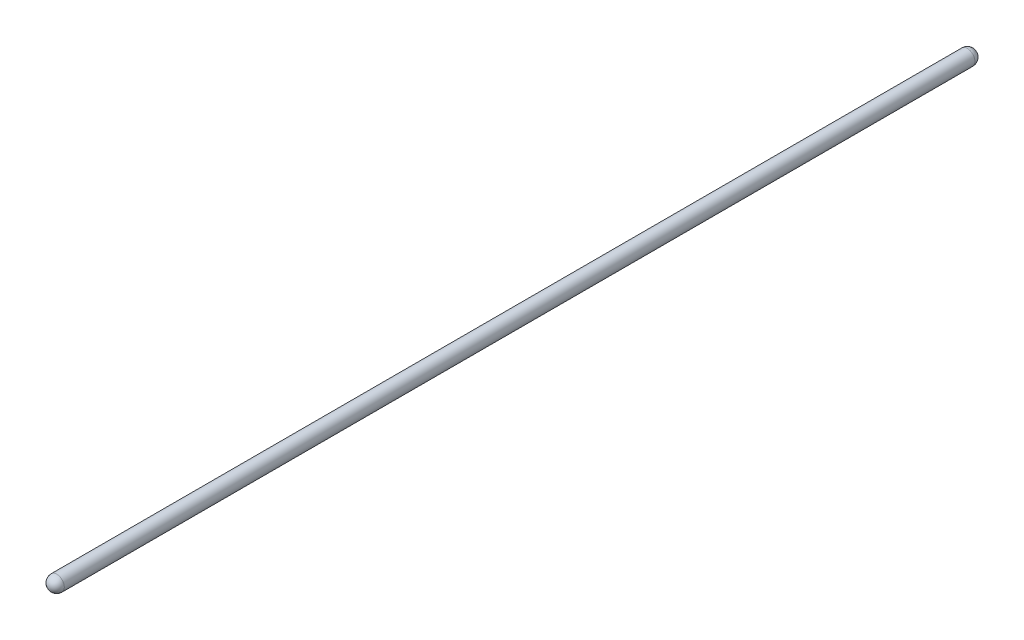
ISO-10303-21;
HEADER;
FILE_DESCRIPTION(('STEP AP214'),'2;1');
FILE_NAME('part.step','',(''),(''),'','','');
FILE_SCHEMA(('AUTOMOTIVE_DESIGN { 1 0 10303 214 1 1 1 1 }'));
ENDSEC;
DATA;
#1=APPLICATION_CONTEXT('core data for automotive mechanical design processes');
#2=APPLICATION_PROTOCOL_DEFINITION('international standard','automotive_design',2000,#1);
#3=PRODUCT_CONTEXT('',#1,'mechanical');
#4=PRODUCT('Part','Part','',(#3));
#5=PRODUCT_RELATED_PRODUCT_CATEGORY('part','',(#4));
#6=PRODUCT_DEFINITION_FORMATION('','',#4);
#7=PRODUCT_DEFINITION_CONTEXT('part definition',#1,'design');
#8=PRODUCT_DEFINITION('design','',#6,#7);
#9=PRODUCT_DEFINITION_SHAPE('','',#8);
#10=(LENGTH_UNIT() NAMED_UNIT(*) SI_UNIT(.MILLI.,.METRE.));
#11=(NAMED_UNIT(*) PLANE_ANGLE_UNIT() SI_UNIT($,.RADIAN.));
#12=(NAMED_UNIT(*) SI_UNIT($,.STERADIAN.) SOLID_ANGLE_UNIT());
#13=UNCERTAINTY_MEASURE_WITH_UNIT(LENGTH_MEASURE(1.E-05),#10,'distance_accuracy_value','');
#14=(GEOMETRIC_REPRESENTATION_CONTEXT(3) GLOBAL_UNCERTAINTY_ASSIGNED_CONTEXT((#13)) GLOBAL_UNIT_ASSIGNED_CONTEXT((#10,
#11,#12)) REPRESENTATION_CONTEXT('',''));
#15=CARTESIAN_POINT('',(0.,0.,0.));
#16=DIRECTION('',(0.,0.,1.));
#17=DIRECTION('',(1.,0.,0.));
#18=AXIS2_PLACEMENT_3D('',#15,#16,#17);
#19=CARTESIAN_POINT('',(0.,0.,300.));
#20=DIRECTION('',(0.,0.,-1.));
#21=DIRECTION('',(-1.,0.,0.));
#22=AXIS2_PLACEMENT_3D('',#19,#20,#21);
#23=CYLINDRICAL_SURFACE('',#22,5.);
#24=CARTESIAN_POINT('',(0.,0.,300.));
#25=DIRECTION('',(0.,0.,1.));
#26=DIRECTION('',(1.,0.,0.));
#27=AXIS2_PLACEMENT_3D('',#24,#25,#26);
#28=CIRCLE('',#27,5.);
#29=CARTESIAN_POINT('',(5.,0.,300.));
#30=VERTEX_POINT('',#29);
#31=EDGE_CURVE('E10',#30,#30,#28,.T.);
#32=ORIENTED_EDGE('',*,*,#31,.F.);
#33=EDGE_LOOP('',(#32));
#34=FACE_BOUND('',#33,.T.);
#35=CARTESIAN_POINT('',(0.,0.,-300.));
#36=DIRECTION('',(0.,0.,-1.));
#37=DIRECTION('',(-1.,0.,0.));
#38=AXIS2_PLACEMENT_3D('',#35,#36,#37);
#39=CIRCLE('',#38,5.);
#40=CARTESIAN_POINT('',(-5.,0.,-300.));
#41=VERTEX_POINT('',#40);
#42=EDGE_CURVE('E40',#41,#41,#39,.T.);
#43=ORIENTED_EDGE('',*,*,#42,.F.);
#44=EDGE_LOOP('',(#43));
#45=FACE_BOUND('',#44,.T.);
#46=ADVANCED_FACE('F34',(#34,#45),#23,.T.);
#47=CARTESIAN_POINT('',(0.,0.,300.));
#48=DIRECTION('',(0.,-1.,0.));
#49=DIRECTION('',(1.,0.,0.));
#50=AXIS2_PLACEMENT_3D('',#47,#48,#49);
#51=SPHERICAL_SURFACE('',#50,5.);
#52=CARTESIAN_POINT('',(0.,0.,300.));
#53=DIRECTION('',(0.,0.,1.));
#54=DIRECTION('',(1.,0.,0.));
#55=AXIS2_PLACEMENT_3D('',#52,#53,#54);
#56=SPHERICAL_SURFACE('',#55,5.);
#57=ORIENTED_EDGE('',*,*,#31,.T.);
#58=EDGE_LOOP('',(#57));
#59=FACE_BOUND('',#58,.T.);
#60=ADVANCED_FACE('F49',(#59),#56,.T.);
#61=CARTESIAN_POINT('',(0.,0.,-300.));
#62=DIRECTION('',(0.,-1.,0.));
#63=DIRECTION('',(1.,0.,0.));
#64=AXIS2_PLACEMENT_3D('',#61,#62,#63);
#65=SPHERICAL_SURFACE('',#64,5.);
#66=CARTESIAN_POINT('',(0.,0.,-300.));
#67=DIRECTION('',(0.,0.,-1.));
#68=DIRECTION('',(-1.,0.,0.));
#69=AXIS2_PLACEMENT_3D('',#66,#67,#68);
#70=SPHERICAL_SURFACE('',#69,5.);
#71=ORIENTED_EDGE('',*,*,#42,.T.);
#72=EDGE_LOOP('',(#71));
#73=FACE_BOUND('',#72,.T.);
#74=ADVANCED_FACE('F46',(#73),#70,.T.);
#75=CLOSED_SHELL('',(#46,#60,#74));
#76=MANIFOLD_SOLID_BREP('B2',#75);
#77=ADVANCED_BREP_SHAPE_REPRESENTATION('',(#18,#76),#14);
#78=SHAPE_DEFINITION_REPRESENTATION(#9,#77);
ENDSEC;
END-ISO-10303-21;
